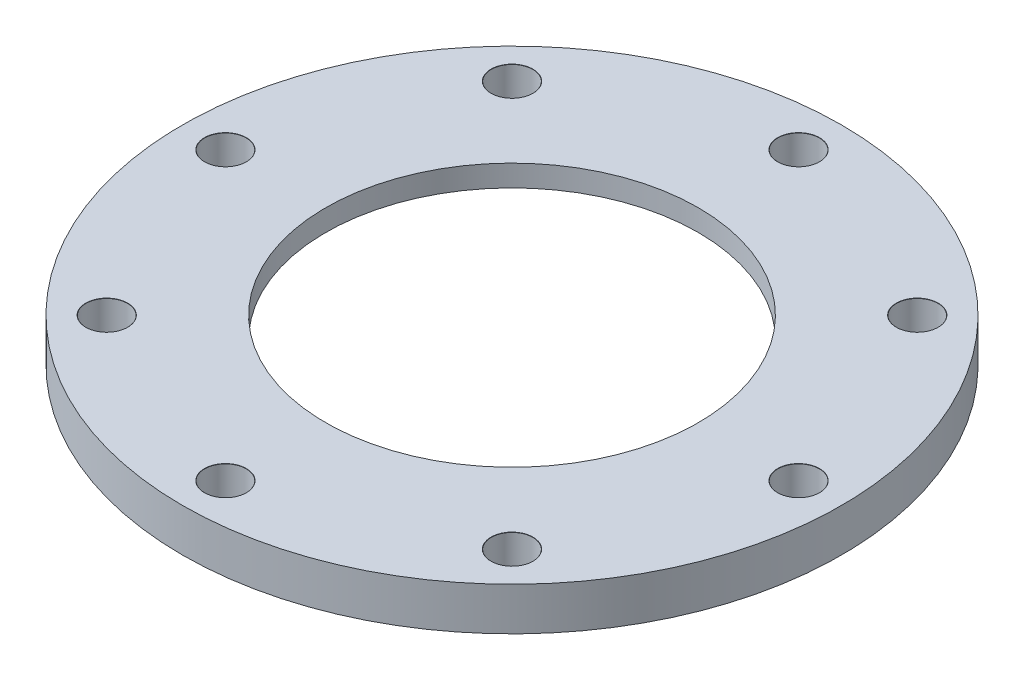
ISO-10303-21;
HEADER;
FILE_DESCRIPTION(('STEP AP214'),'2;1');
FILE_NAME('part.step','',(''),(''),'','','');
FILE_SCHEMA(('AUTOMOTIVE_DESIGN { 1 0 10303 214 1 1 1 1 }'));
ENDSEC;
DATA;
#1=APPLICATION_CONTEXT('core data for automotive mechanical design processes');
#2=APPLICATION_PROTOCOL_DEFINITION('international standard','automotive_design',2000,#1);
#3=PRODUCT_CONTEXT('',#1,'mechanical');
#4=PRODUCT('Part','Part','',(#3));
#5=PRODUCT_RELATED_PRODUCT_CATEGORY('part','',(#4));
#6=PRODUCT_DEFINITION_FORMATION('','',#4);
#7=PRODUCT_DEFINITION_CONTEXT('part definition',#1,'design');
#8=PRODUCT_DEFINITION('design','',#6,#7);
#9=PRODUCT_DEFINITION_SHAPE('','',#8);
#10=(LENGTH_UNIT() NAMED_UNIT(*) SI_UNIT(.MILLI.,.METRE.));
#11=(NAMED_UNIT(*) PLANE_ANGLE_UNIT() SI_UNIT($,.RADIAN.));
#12=(NAMED_UNIT(*) SI_UNIT($,.STERADIAN.) SOLID_ANGLE_UNIT());
#13=UNCERTAINTY_MEASURE_WITH_UNIT(LENGTH_MEASURE(1.E-05),#10,'distance_accuracy_value','');
#14=(GEOMETRIC_REPRESENTATION_CONTEXT(3) GLOBAL_UNCERTAINTY_ASSIGNED_CONTEXT((#13)) GLOBAL_UNIT_ASSIGNED_CONTEXT((#10,
#11,#12)) REPRESENTATION_CONTEXT('',''));
#15=CARTESIAN_POINT('',(0.,0.,0.));
#16=DIRECTION('',(0.,0.,1.));
#17=DIRECTION('',(1.,0.,0.));
#18=AXIS2_PLACEMENT_3D('',#15,#16,#17);
#19=CARTESIAN_POINT('',(-46.,6.,0.));
#20=DIRECTION('',(0.,-1.,0.));
#21=DIRECTION('',(0.,0.,-1.));
#22=AXIS2_PLACEMENT_3D('',#19,#20,#21);
#23=PLANE('',#22);
#24=CARTESIAN_POINT('',(28.2842712474622,6.,28.2842712474616));
#25=DIRECTION('',(0.,1.,0.));
#26=DIRECTION('',(0.,0.,1.));
#27=AXIS2_PLACEMENT_3D('',#24,#25,#26);
#28=CIRCLE('',#27,2.925);
#29=CARTESIAN_POINT('',(28.2842712474622,6.,31.2092712474616));
#30=VERTEX_POINT('',#29);
#31=EDGE_CURVE('E129',#30,#30,#28,.T.);
#32=ORIENTED_EDGE('',*,*,#31,.F.);
#33=EDGE_LOOP('',(#32));
#34=FACE_BOUND('',#33,.T.);
#35=CARTESIAN_POINT('',(4.18977760661176E-13,6.,40.));
#36=DIRECTION('',(0.,1.,0.));
#37=DIRECTION('',(0.,0.,1.));
#38=AXIS2_PLACEMENT_3D('',#35,#36,#37);
#39=CIRCLE('',#38,2.925);
#40=CARTESIAN_POINT('',(4.18977760661176E-13,6.,42.925));
#41=VERTEX_POINT('',#40);
#42=EDGE_CURVE('E120',#41,#41,#39,.T.);
#43=ORIENTED_EDGE('',*,*,#42,.F.);
#44=EDGE_LOOP('',(#43));
#45=FACE_BOUND('',#44,.T.);
#46=CARTESIAN_POINT('',(-1.39659253553725E-13,6.,-40.));
#47=DIRECTION('',(0.,1.,0.));
#48=DIRECTION('',(0.,0.,1.));
#49=AXIS2_PLACEMENT_3D('',#46,#47,#48);
#50=CIRCLE('',#49,2.925);
#51=CARTESIAN_POINT('',(-1.39659253553725E-13,6.,-37.075));
#52=VERTEX_POINT('',#51);
#53=EDGE_CURVE('E84',#52,#52,#50,.T.);
#54=ORIENTED_EDGE('',*,*,#53,.F.);
#55=EDGE_LOOP('',(#54));
#56=FACE_BOUND('',#55,.T.);
#57=CARTESIAN_POINT('',(28.2842712474619,6.,-28.284271247462));
#58=DIRECTION('',(0.,1.,0.));
#59=DIRECTION('',(0.,0.,1.));
#60=AXIS2_PLACEMENT_3D('',#57,#58,#59);
#61=CIRCLE('',#60,2.925);
#62=CARTESIAN_POINT('',(28.2842712474619,6.,-25.359271247462));
#63=VERTEX_POINT('',#62);
#64=EDGE_CURVE('E75',#63,#63,#61,.T.);
#65=ORIENTED_EDGE('',*,*,#64,.F.);
#66=EDGE_LOOP('',(#65));
#67=FACE_BOUND('',#66,.T.);
#68=CARTESIAN_POINT('',(40.,6.,0.));
#69=DIRECTION('',(0.,1.,0.));
#70=DIRECTION('',(0.,0.,1.));
#71=AXIS2_PLACEMENT_3D('',#68,#69,#70);
#72=CIRCLE('',#71,2.925);
#73=CARTESIAN_POINT('',(40.,6.,2.925));
#74=VERTEX_POINT('',#73);
#75=EDGE_CURVE('E66',#74,#74,#72,.T.);
#76=ORIENTED_EDGE('',*,*,#75,.F.);
#77=EDGE_LOOP('',(#76));
#78=FACE_BOUND('',#77,.T.);
#79=CARTESIAN_POINT('',(0.,6.,0.));
#80=DIRECTION('',(0.,-1.,0.));
#81=DIRECTION('',(0.,0.,-1.));
#82=AXIS2_PLACEMENT_3D('',#79,#80,#81);
#83=CIRCLE('',#82,46.);
#84=CARTESIAN_POINT('',(0.,6.,-46.));
#85=VERTEX_POINT('',#84);
#86=EDGE_CURVE('E45',#85,#85,#83,.T.);
#87=ORIENTED_EDGE('',*,*,#86,.F.);
#88=EDGE_LOOP('',(#87));
#89=FACE_BOUND('',#88,.T.);
#90=CARTESIAN_POINT('',(0.,6.,0.));
#91=DIRECTION('',(0.,-1.,0.));
#92=DIRECTION('',(0.,0.,-1.));
#93=AXIS2_PLACEMENT_3D('',#90,#91,#92);
#94=CIRCLE('',#93,26.);
#95=CARTESIAN_POINT('',(0.,6.,-26.));
#96=VERTEX_POINT('',#95);
#97=EDGE_CURVE('E49',#96,#96,#94,.T.);
#98=ORIENTED_EDGE('',*,*,#97,.T.);
#99=EDGE_LOOP('',(#98));
#100=FACE_BOUND('',#99,.T.);
#101=CARTESIAN_POINT('',(-28.2842712474621,6.,-28.2842712474618));
#102=DIRECTION('',(0.,1.,0.));
#103=DIRECTION('',(0.,0.,1.));
#104=AXIS2_PLACEMENT_3D('',#101,#102,#103);
#105=CIRCLE('',#104,2.925);
#106=CARTESIAN_POINT('',(-28.2842712474621,6.,-25.3592712474618));
#107=VERTEX_POINT('',#106);
#108=EDGE_CURVE('E93',#107,#107,#105,.T.);
#109=ORIENTED_EDGE('',*,*,#108,.F.);
#110=EDGE_LOOP('',(#109));
#111=FACE_BOUND('',#110,.T.);
#112=CARTESIAN_POINT('',(-40.,6.,0.));
#113=DIRECTION('',(0.,1.,0.));
#114=DIRECTION('',(0.,0.,1.));
#115=AXIS2_PLACEMENT_3D('',#112,#113,#114);
#116=CIRCLE('',#115,2.925);
#117=CARTESIAN_POINT('',(-40.,6.,2.925));
#118=VERTEX_POINT('',#117);
#119=EDGE_CURVE('E102',#118,#118,#116,.T.);
#120=ORIENTED_EDGE('',*,*,#119,.F.);
#121=EDGE_LOOP('',(#120));
#122=FACE_BOUND('',#121,.T.);
#123=CARTESIAN_POINT('',(-28.2842712474617,6.,28.2842712474621));
#124=DIRECTION('',(0.,1.,0.));
#125=DIRECTION('',(0.,0.,1.));
#126=AXIS2_PLACEMENT_3D('',#123,#124,#125);
#127=CIRCLE('',#126,2.925);
#128=CARTESIAN_POINT('',(-28.2842712474617,6.,31.2092712474621));
#129=VERTEX_POINT('',#128);
#130=EDGE_CURVE('E111',#129,#129,#127,.T.);
#131=ORIENTED_EDGE('',*,*,#130,.F.);
#132=EDGE_LOOP('',(#131));
#133=FACE_BOUND('',#132,.T.);
#134=ADVANCED_FACE('F34',(#34,#45,#56,#67,#78,#89,#100,#111,#122,#133),#23,.F.);
#135=CARTESIAN_POINT('',(0.,0.,0.));
#136=DIRECTION('',(0.,-1.,0.));
#137=DIRECTION('',(0.,0.,-1.));
#138=AXIS2_PLACEMENT_3D('',#135,#136,#137);
#139=CYLINDRICAL_SURFACE('',#138,32.);
#140=CARTESIAN_POINT('',(0.,3.,0.));
#141=DIRECTION('',(0.,-1.,0.));
#142=DIRECTION('',(0.,0.,-1.));
#143=AXIS2_PLACEMENT_3D('',#140,#141,#142);
#144=CIRCLE('',#143,32.);
#145=CARTESIAN_POINT('',(0.,3.,-32.));
#146=VERTEX_POINT('',#145);
#147=EDGE_CURVE('E57',#146,#146,#144,.T.);
#148=ORIENTED_EDGE('',*,*,#147,.F.);
#149=EDGE_LOOP('',(#148));
#150=FACE_BOUND('',#149,.T.);
#151=CARTESIAN_POINT('',(0.,0.,0.));
#152=DIRECTION('',(0.,-1.,0.));
#153=DIRECTION('',(0.,0.,-1.));
#154=AXIS2_PLACEMENT_3D('',#151,#152,#153);
#155=CIRCLE('',#154,32.);
#156=CARTESIAN_POINT('',(0.,0.,-32.));
#157=VERTEX_POINT('',#156);
#158=EDGE_CURVE('E10',#157,#157,#155,.T.);
#159=ORIENTED_EDGE('',*,*,#158,.T.);
#160=EDGE_LOOP('',(#159));
#161=FACE_BOUND('',#160,.T.);
#162=ADVANCED_FACE('F36',(#150,#161),#139,.F.);
#163=CARTESIAN_POINT('',(-32.,0.,0.));
#164=DIRECTION('',(0.,1.,0.));
#165=DIRECTION('',(0.,0.,1.));
#166=AXIS2_PLACEMENT_3D('',#163,#164,#165);
#167=PLANE('',#166);
#168=CARTESIAN_POINT('',(28.2842712474622,0.,28.2842712474616));
#169=DIRECTION('',(0.,1.,0.));
#170=DIRECTION('',(0.,0.,1.));
#171=AXIS2_PLACEMENT_3D('',#168,#169,#170);
#172=CIRCLE('',#171,2.9);
#173=CARTESIAN_POINT('',(28.2842712474622,0.,31.1842712474616));
#174=VERTEX_POINT('',#173);
#175=EDGE_CURVE('E123',#174,#174,#172,.T.);
#176=ORIENTED_EDGE('',*,*,#175,.T.);
#177=EDGE_LOOP('',(#176));
#178=FACE_BOUND('',#177,.T.);
#179=CARTESIAN_POINT('',(4.18977760661176E-13,0.,40.));
#180=DIRECTION('',(0.,1.,0.));
#181=DIRECTION('',(0.,0.,1.));
#182=AXIS2_PLACEMENT_3D('',#179,#180,#181);
#183=CIRCLE('',#182,2.9);
#184=CARTESIAN_POINT('',(4.18977760661176E-13,0.,42.9));
#185=VERTEX_POINT('',#184);
#186=EDGE_CURVE('E114',#185,#185,#183,.T.);
#187=ORIENTED_EDGE('',*,*,#186,.T.);
#188=EDGE_LOOP('',(#187));
#189=FACE_BOUND('',#188,.T.);
#190=CARTESIAN_POINT('',(-28.2842712474617,0.,28.2842712474621));
#191=DIRECTION('',(0.,1.,0.));
#192=DIRECTION('',(0.,0.,1.));
#193=AXIS2_PLACEMENT_3D('',#190,#191,#192);
#194=CIRCLE('',#193,2.9);
#195=CARTESIAN_POINT('',(-28.2842712474617,0.,31.1842712474621));
#196=VERTEX_POINT('',#195);
#197=EDGE_CURVE('E105',#196,#196,#194,.T.);
#198=ORIENTED_EDGE('',*,*,#197,.T.);
#199=EDGE_LOOP('',(#198));
#200=FACE_BOUND('',#199,.T.);
#201=CARTESIAN_POINT('',(-40.,0.,0.));
#202=DIRECTION('',(0.,1.,0.));
#203=DIRECTION('',(0.,0.,1.));
#204=AXIS2_PLACEMENT_3D('',#201,#202,#203);
#205=CIRCLE('',#204,2.9);
#206=CARTESIAN_POINT('',(-40.,0.,2.9));
#207=VERTEX_POINT('',#206);
#208=EDGE_CURVE('E96',#207,#207,#205,.T.);
#209=ORIENTED_EDGE('',*,*,#208,.T.);
#210=EDGE_LOOP('',(#209));
#211=FACE_BOUND('',#210,.T.);
#212=CARTESIAN_POINT('',(-28.2842712474621,0.,-28.2842712474618));
#213=DIRECTION('',(0.,1.,0.));
#214=DIRECTION('',(0.,0.,1.));
#215=AXIS2_PLACEMENT_3D('',#212,#213,#214);
#216=CIRCLE('',#215,2.9);
#217=CARTESIAN_POINT('',(-28.2842712474621,0.,-25.3842712474618));
#218=VERTEX_POINT('',#217);
#219=EDGE_CURVE('E87',#218,#218,#216,.T.);
#220=ORIENTED_EDGE('',*,*,#219,.T.);
#221=EDGE_LOOP('',(#220));
#222=FACE_BOUND('',#221,.T.);
#223=CARTESIAN_POINT('',(-1.39659253553725E-13,0.,-40.));
#224=DIRECTION('',(0.,1.,0.));
#225=DIRECTION('',(0.,0.,1.));
#226=AXIS2_PLACEMENT_3D('',#223,#224,#225);
#227=CIRCLE('',#226,2.9);
#228=CARTESIAN_POINT('',(-1.39659253553725E-13,0.,-37.1));
#229=VERTEX_POINT('',#228);
#230=EDGE_CURVE('E78',#229,#229,#227,.T.);
#231=ORIENTED_EDGE('',*,*,#230,.T.);
#232=EDGE_LOOP('',(#231));
#233=FACE_BOUND('',#232,.T.);
#234=CARTESIAN_POINT('',(28.2842712474619,0.,-28.284271247462));
#235=DIRECTION('',(0.,1.,0.));
#236=DIRECTION('',(0.,0.,1.));
#237=AXIS2_PLACEMENT_3D('',#234,#235,#236);
#238=CIRCLE('',#237,2.9);
#239=CARTESIAN_POINT('',(28.2842712474619,0.,-25.384271247462));
#240=VERTEX_POINT('',#239);
#241=EDGE_CURVE('E69',#240,#240,#238,.T.);
#242=ORIENTED_EDGE('',*,*,#241,.T.);
#243=EDGE_LOOP('',(#242));
#244=FACE_BOUND('',#243,.T.);
#245=CARTESIAN_POINT('',(40.,0.,0.));
#246=DIRECTION('',(0.,1.,0.));
#247=DIRECTION('',(0.,0.,1.));
#248=AXIS2_PLACEMENT_3D('',#245,#246,#247);
#249=CIRCLE('',#248,2.9);
#250=CARTESIAN_POINT('',(40.,0.,2.9));
#251=VERTEX_POINT('',#250);
#252=EDGE_CURVE('E60',#251,#251,#249,.T.);
#253=ORIENTED_EDGE('',*,*,#252,.T.);
#254=EDGE_LOOP('',(#253));
#255=FACE_BOUND('',#254,.T.);
#256=ORIENTED_EDGE('',*,*,#158,.F.);
#257=EDGE_LOOP('',(#256));
#258=FACE_BOUND('',#257,.T.);
#259=CARTESIAN_POINT('',(0.,0.,0.));
#260=DIRECTION('',(0.,-1.,0.));
#261=DIRECTION('',(0.,0.,-1.));
#262=AXIS2_PLACEMENT_3D('',#259,#260,#261);
#263=CIRCLE('',#262,46.);
#264=CARTESIAN_POINT('',(0.,0.,-46.));
#265=VERTEX_POINT('',#264);
#266=EDGE_CURVE('E41',#265,#265,#263,.T.);
#267=ORIENTED_EDGE('',*,*,#266,.T.);
#268=EDGE_LOOP('',(#267));
#269=FACE_BOUND('',#268,.T.);
#270=ADVANCED_FACE('F224',(#178,#189,#200,#211,#222,#233,#244,#255,#258,#269),#167,.F.);
#271=CARTESIAN_POINT('',(0.,0.,0.));
#272=DIRECTION('',(0.,-1.,0.));
#273=DIRECTION('',(0.,0.,-1.));
#274=AXIS2_PLACEMENT_3D('',#271,#272,#273);
#275=CYLINDRICAL_SURFACE('',#274,46.);
#276=ORIENTED_EDGE('',*,*,#266,.F.);
#277=EDGE_LOOP('',(#276));
#278=FACE_BOUND('',#277,.T.);
#279=ORIENTED_EDGE('',*,*,#86,.T.);
#280=EDGE_LOOP('',(#279));
#281=FACE_BOUND('',#280,.T.);
#282=ADVANCED_FACE('F220',(#278,#281),#275,.T.);
#283=CARTESIAN_POINT('',(0.,0.,0.));
#284=DIRECTION('',(0.,-1.,0.));
#285=DIRECTION('',(0.,0.,-1.));
#286=AXIS2_PLACEMENT_3D('',#283,#284,#285);
#287=CYLINDRICAL_SURFACE('',#286,26.);
#288=ORIENTED_EDGE('',*,*,#97,.F.);
#289=EDGE_LOOP('',(#288));
#290=FACE_BOUND('',#289,.T.);
#291=CARTESIAN_POINT('',(0.,3.,0.));
#292=DIRECTION('',(0.,-1.,0.));
#293=DIRECTION('',(0.,0.,-1.));
#294=AXIS2_PLACEMENT_3D('',#291,#292,#293);
#295=CIRCLE('',#294,26.);
#296=CARTESIAN_POINT('',(0.,3.,-26.));
#297=VERTEX_POINT('',#296);
#298=EDGE_CURVE('E54',#297,#297,#295,.T.);
#299=ORIENTED_EDGE('',*,*,#298,.T.);
#300=EDGE_LOOP('',(#299));
#301=FACE_BOUND('',#300,.T.);
#302=ADVANCED_FACE('F217',(#290,#301),#287,.F.);
#303=CARTESIAN_POINT('',(-26.,3.,0.));
#304=DIRECTION('',(0.,1.,0.));
#305=DIRECTION('',(0.,0.,1.));
#306=AXIS2_PLACEMENT_3D('',#303,#304,#305);
#307=PLANE('',#306);
#308=ORIENTED_EDGE('',*,*,#298,.F.);
#309=EDGE_LOOP('',(#308));
#310=FACE_BOUND('',#309,.T.);
#311=ORIENTED_EDGE('',*,*,#147,.T.);
#312=EDGE_LOOP('',(#311));
#313=FACE_BOUND('',#312,.T.);
#314=ADVANCED_FACE('F213',(#310,#313),#307,.F.);
#315=CARTESIAN_POINT('',(40.,6.,0.));
#316=DIRECTION('',(0.,1.,0.));
#317=DIRECTION('',(0.,0.,1.));
#318=AXIS2_PLACEMENT_3D('',#315,#316,#317);
#319=CYLINDRICAL_SURFACE('',#318,2.9);
#320=ORIENTED_EDGE('',*,*,#252,.F.);
#321=EDGE_LOOP('',(#320));
#322=FACE_BOUND('',#321,.T.);
#323=CARTESIAN_POINT('',(40.,5.97499999999999,0.));
#324=DIRECTION('',(0.,1.,0.));
#325=DIRECTION('',(0.,0.,1.));
#326=AXIS2_PLACEMENT_3D('',#323,#324,#325);
#327=CIRCLE('',#326,2.9);
#328=CARTESIAN_POINT('',(40.,5.97499999999999,2.9));
#329=VERTEX_POINT('',#328);
#330=EDGE_CURVE('E63',#329,#329,#327,.T.);
#331=ORIENTED_EDGE('',*,*,#330,.T.);
#332=EDGE_LOOP('',(#331));
#333=FACE_BOUND('',#332,.T.);
#334=ADVANCED_FACE('F209',(#322,#333),#319,.F.);
#335=CARTESIAN_POINT('',(40.,6.,0.));
#336=DIRECTION('',(0.,1.,0.));
#337=DIRECTION('',(0.,0.,1.));
#338=AXIS2_PLACEMENT_3D('',#335,#336,#337);
#339=CONICAL_SURFACE('',#338,2.925,0.785398163397448);
#340=ORIENTED_EDGE('',*,*,#330,.F.);
#341=EDGE_LOOP('',(#340));
#342=FACE_BOUND('',#341,.T.);
#343=ORIENTED_EDGE('',*,*,#75,.T.);
#344=EDGE_LOOP('',(#343));
#345=FACE_BOUND('',#344,.T.);
#346=ADVANCED_FACE('F205',(#342,#345),#339,.F.);
#347=CARTESIAN_POINT('',(28.2842712474619,6.,-28.284271247462));
#348=DIRECTION('',(0.,1.,0.));
#349=DIRECTION('',(0.,0.,1.));
#350=AXIS2_PLACEMENT_3D('',#347,#348,#349);
#351=CYLINDRICAL_SURFACE('',#350,2.9);
#352=ORIENTED_EDGE('',*,*,#241,.F.);
#353=EDGE_LOOP('',(#352));
#354=FACE_BOUND('',#353,.T.);
#355=CARTESIAN_POINT('',(28.2842712474619,5.97499999999999,-28.284271247462));
#356=DIRECTION('',(0.,1.,0.));
#357=DIRECTION('',(0.,0.,1.));
#358=AXIS2_PLACEMENT_3D('',#355,#356,#357);
#359=CIRCLE('',#358,2.9);
#360=CARTESIAN_POINT('',(28.2842712474619,5.97499999999999,-25.384271247462));
#361=VERTEX_POINT('',#360);
#362=EDGE_CURVE('E72',#361,#361,#359,.T.);
#363=ORIENTED_EDGE('',*,*,#362,.T.);
#364=EDGE_LOOP('',(#363));
#365=FACE_BOUND('',#364,.T.);
#366=ADVANCED_FACE('F201',(#354,#365),#351,.F.);
#367=CARTESIAN_POINT('',(28.2842712474619,6.,-28.284271247462));
#368=DIRECTION('',(0.,1.,0.));
#369=DIRECTION('',(0.,0.,1.));
#370=AXIS2_PLACEMENT_3D('',#367,#368,#369);
#371=CONICAL_SURFACE('',#370,2.925,0.785398163397448);
#372=ORIENTED_EDGE('',*,*,#362,.F.);
#373=EDGE_LOOP('',(#372));
#374=FACE_BOUND('',#373,.T.);
#375=ORIENTED_EDGE('',*,*,#64,.T.);
#376=EDGE_LOOP('',(#375));
#377=FACE_BOUND('',#376,.T.);
#378=ADVANCED_FACE('F197',(#374,#377),#371,.F.);
#379=CARTESIAN_POINT('',(-1.39659253553725E-13,6.,-40.));
#380=DIRECTION('',(0.,1.,0.));
#381=DIRECTION('',(0.,0.,1.));
#382=AXIS2_PLACEMENT_3D('',#379,#380,#381);
#383=CYLINDRICAL_SURFACE('',#382,2.9);
#384=ORIENTED_EDGE('',*,*,#230,.F.);
#385=EDGE_LOOP('',(#384));
#386=FACE_BOUND('',#385,.T.);
#387=CARTESIAN_POINT('',(-1.39659253553725E-13,5.97499999999999,-40.));
#388=DIRECTION('',(0.,1.,0.));
#389=DIRECTION('',(0.,0.,1.));
#390=AXIS2_PLACEMENT_3D('',#387,#388,#389);
#391=CIRCLE('',#390,2.9);
#392=CARTESIAN_POINT('',(-1.39659253553725E-13,5.97499999999999,-37.1));
#393=VERTEX_POINT('',#392);
#394=EDGE_CURVE('E81',#393,#393,#391,.T.);
#395=ORIENTED_EDGE('',*,*,#394,.T.);
#396=EDGE_LOOP('',(#395));
#397=FACE_BOUND('',#396,.T.);
#398=ADVANCED_FACE('F193',(#386,#397),#383,.F.);
#399=CARTESIAN_POINT('',(-1.39659253553725E-13,6.,-40.));
#400=DIRECTION('',(0.,1.,0.));
#401=DIRECTION('',(0.,0.,1.));
#402=AXIS2_PLACEMENT_3D('',#399,#400,#401);
#403=CONICAL_SURFACE('',#402,2.925,0.785398163397431);
#404=ORIENTED_EDGE('',*,*,#394,.F.);
#405=EDGE_LOOP('',(#404));
#406=FACE_BOUND('',#405,.T.);
#407=ORIENTED_EDGE('',*,*,#53,.T.);
#408=EDGE_LOOP('',(#407));
#409=FACE_BOUND('',#408,.T.);
#410=ADVANCED_FACE('F189',(#406,#409),#403,.F.);
#411=CARTESIAN_POINT('',(-28.2842712474621,6.,-28.2842712474618));
#412=DIRECTION('',(0.,1.,0.));
#413=DIRECTION('',(0.,0.,1.));
#414=AXIS2_PLACEMENT_3D('',#411,#412,#413);
#415=CYLINDRICAL_SURFACE('',#414,2.9);
#416=ORIENTED_EDGE('',*,*,#219,.F.);
#417=EDGE_LOOP('',(#416));
#418=FACE_BOUND('',#417,.T.);
#419=CARTESIAN_POINT('',(-28.2842712474621,5.97499999999999,-28.2842712474618));
#420=DIRECTION('',(0.,1.,0.));
#421=DIRECTION('',(0.,0.,1.));
#422=AXIS2_PLACEMENT_3D('',#419,#420,#421);
#423=CIRCLE('',#422,2.9);
#424=CARTESIAN_POINT('',(-28.2842712474621,5.97499999999999,-25.3842712474618));
#425=VERTEX_POINT('',#424);
#426=EDGE_CURVE('E90',#425,#425,#423,.T.);
#427=ORIENTED_EDGE('',*,*,#426,.T.);
#428=EDGE_LOOP('',(#427));
#429=FACE_BOUND('',#428,.T.);
#430=ADVANCED_FACE('F185',(#418,#429),#415,.F.);
#431=CARTESIAN_POINT('',(-28.2842712474621,6.,-28.2842712474618));
#432=DIRECTION('',(0.,1.,0.));
#433=DIRECTION('',(0.,0.,1.));
#434=AXIS2_PLACEMENT_3D('',#431,#432,#433);
#435=CONICAL_SURFACE('',#434,2.925,0.785398163397448);
#436=ORIENTED_EDGE('',*,*,#426,.F.);
#437=EDGE_LOOP('',(#436));
#438=FACE_BOUND('',#437,.T.);
#439=ORIENTED_EDGE('',*,*,#108,.T.);
#440=EDGE_LOOP('',(#439));
#441=FACE_BOUND('',#440,.T.);
#442=ADVANCED_FACE('F181',(#438,#441),#435,.F.);
#443=CARTESIAN_POINT('',(-40.,6.,0.));
#444=DIRECTION('',(0.,1.,0.));
#445=DIRECTION('',(0.,0.,1.));
#446=AXIS2_PLACEMENT_3D('',#443,#444,#445);
#447=CYLINDRICAL_SURFACE('',#446,2.9);
#448=ORIENTED_EDGE('',*,*,#208,.F.);
#449=EDGE_LOOP('',(#448));
#450=FACE_BOUND('',#449,.T.);
#451=CARTESIAN_POINT('',(-40.,5.97499999999999,0.));
#452=DIRECTION('',(0.,1.,0.));
#453=DIRECTION('',(0.,0.,1.));
#454=AXIS2_PLACEMENT_3D('',#451,#452,#453);
#455=CIRCLE('',#454,2.9);
#456=CARTESIAN_POINT('',(-40.,5.97499999999999,2.9));
#457=VERTEX_POINT('',#456);
#458=EDGE_CURVE('E99',#457,#457,#455,.T.);
#459=ORIENTED_EDGE('',*,*,#458,.T.);
#460=EDGE_LOOP('',(#459));
#461=FACE_BOUND('',#460,.T.);
#462=ADVANCED_FACE('F177',(#450,#461),#447,.F.);
#463=CARTESIAN_POINT('',(-40.,6.,0.));
#464=DIRECTION('',(0.,1.,0.));
#465=DIRECTION('',(0.,0.,1.));
#466=AXIS2_PLACEMENT_3D('',#463,#464,#465);
#467=CONICAL_SURFACE('',#466,2.925,0.785398163397448);
#468=ORIENTED_EDGE('',*,*,#458,.F.);
#469=EDGE_LOOP('',(#468));
#470=FACE_BOUND('',#469,.T.);
#471=ORIENTED_EDGE('',*,*,#119,.T.);
#472=EDGE_LOOP('',(#471));
#473=FACE_BOUND('',#472,.T.);
#474=ADVANCED_FACE('F169',(#470,#473),#467,.F.);
#475=CARTESIAN_POINT('',(-28.2842712474617,6.,28.2842712474621));
#476=DIRECTION('',(0.,1.,0.));
#477=DIRECTION('',(0.,0.,1.));
#478=AXIS2_PLACEMENT_3D('',#475,#476,#477);
#479=CYLINDRICAL_SURFACE('',#478,2.9);
#480=ORIENTED_EDGE('',*,*,#197,.F.);
#481=EDGE_LOOP('',(#480));
#482=FACE_BOUND('',#481,.T.);
#483=CARTESIAN_POINT('',(-28.2842712474617,5.97499999999999,28.2842712474621));
#484=DIRECTION('',(0.,1.,0.));
#485=DIRECTION('',(0.,0.,1.));
#486=AXIS2_PLACEMENT_3D('',#483,#484,#485);
#487=CIRCLE('',#486,2.9);
#488=CARTESIAN_POINT('',(-28.2842712474617,5.97499999999999,31.1842712474621));
#489=VERTEX_POINT('',#488);
#490=EDGE_CURVE('E108',#489,#489,#487,.T.);
#491=ORIENTED_EDGE('',*,*,#490,.T.);
#492=EDGE_LOOP('',(#491));
#493=FACE_BOUND('',#492,.T.);
#494=ADVANCED_FACE('F159',(#482,#493),#479,.F.);
#495=CARTESIAN_POINT('',(-28.2842712474617,6.,28.2842712474621));
#496=DIRECTION('',(0.,1.,0.));
#497=DIRECTION('',(0.,0.,1.));
#498=AXIS2_PLACEMENT_3D('',#495,#496,#497);
#499=CONICAL_SURFACE('',#498,2.925,0.785398163397448);
#500=ORIENTED_EDGE('',*,*,#490,.F.);
#501=EDGE_LOOP('',(#500));
#502=FACE_BOUND('',#501,.T.);
#503=ORIENTED_EDGE('',*,*,#130,.T.);
#504=EDGE_LOOP('',(#503));
#505=FACE_BOUND('',#504,.T.);
#506=ADVANCED_FACE('F156',(#502,#505),#499,.F.);
#507=CARTESIAN_POINT('',(4.18977760661176E-13,6.,40.));
#508=DIRECTION('',(0.,1.,0.));
#509=DIRECTION('',(0.,0.,1.));
#510=AXIS2_PLACEMENT_3D('',#507,#508,#509);
#511=CYLINDRICAL_SURFACE('',#510,2.9);
#512=ORIENTED_EDGE('',*,*,#186,.F.);
#513=EDGE_LOOP('',(#512));
#514=FACE_BOUND('',#513,.T.);
#515=CARTESIAN_POINT('',(4.18977760661176E-13,5.97499999999999,40.));
#516=DIRECTION('',(0.,1.,0.));
#517=DIRECTION('',(0.,0.,1.));
#518=AXIS2_PLACEMENT_3D('',#515,#516,#517);
#519=CIRCLE('',#518,2.9);
#520=CARTESIAN_POINT('',(4.18977760661176E-13,5.97499999999999,42.9));
#521=VERTEX_POINT('',#520);
#522=EDGE_CURVE('E117',#521,#521,#519,.T.);
#523=ORIENTED_EDGE('',*,*,#522,.T.);
#524=EDGE_LOOP('',(#523));
#525=FACE_BOUND('',#524,.T.);
#526=ADVANCED_FACE('F158',(#514,#525),#511,.F.);
#527=CARTESIAN_POINT('',(4.18977760661176E-13,6.,40.));
#528=DIRECTION('',(0.,1.,0.));
#529=DIRECTION('',(0.,0.,1.));
#530=AXIS2_PLACEMENT_3D('',#527,#528,#529);
#531=CONICAL_SURFACE('',#530,2.925,0.785398163397431);
#532=ORIENTED_EDGE('',*,*,#522,.F.);
#533=EDGE_LOOP('',(#532));
#534=FACE_BOUND('',#533,.T.);
#535=ORIENTED_EDGE('',*,*,#42,.T.);
#536=EDGE_LOOP('',(#535));
#537=FACE_BOUND('',#536,.T.);
#538=ADVANCED_FACE('F166',(#534,#537),#531,.F.);
#539=CARTESIAN_POINT('',(28.2842712474622,6.,28.2842712474616));
#540=DIRECTION('',(0.,1.,0.));
#541=DIRECTION('',(0.,0.,1.));
#542=AXIS2_PLACEMENT_3D('',#539,#540,#541);
#543=CYLINDRICAL_SURFACE('',#542,2.9);
#544=ORIENTED_EDGE('',*,*,#175,.F.);
#545=EDGE_LOOP('',(#544));
#546=FACE_BOUND('',#545,.T.);
#547=CARTESIAN_POINT('',(28.2842712474622,5.97499999999999,28.2842712474616));
#548=DIRECTION('',(0.,1.,0.));
#549=DIRECTION('',(0.,0.,1.));
#550=AXIS2_PLACEMENT_3D('',#547,#548,#549);
#551=CIRCLE('',#550,2.9);
#552=CARTESIAN_POINT('',(28.2842712474622,5.97499999999999,31.1842712474616));
#553=VERTEX_POINT('',#552);
#554=EDGE_CURVE('E126',#553,#553,#551,.T.);
#555=ORIENTED_EDGE('',*,*,#554,.T.);
#556=EDGE_LOOP('',(#555));
#557=FACE_BOUND('',#556,.T.);
#558=ADVANCED_FACE('F269',(#546,#557),#543,.F.);
#559=CARTESIAN_POINT('',(28.2842712474622,6.,28.2842712474616));
#560=DIRECTION('',(0.,1.,0.));
#561=DIRECTION('',(0.,0.,1.));
#562=AXIS2_PLACEMENT_3D('',#559,#560,#561);
#563=CONICAL_SURFACE('',#562,2.925,0.785398163397448);
#564=ORIENTED_EDGE('',*,*,#554,.F.);
#565=EDGE_LOOP('',(#564));
#566=FACE_BOUND('',#565,.T.);
#567=ORIENTED_EDGE('',*,*,#31,.T.);
#568=EDGE_LOOP('',(#567));
#569=FACE_BOUND('',#568,.T.);
#570=ADVANCED_FACE('F133',(#566,#569),#563,.F.);
#571=CLOSED_SHELL('',(#134,#162,#270,#282,#302,#314,#334,#346,#366,#378,#398,#410,#430,#442,
#462,#474,#494,#506,#526,#538,#558,#570));
#572=MANIFOLD_SOLID_BREP('B2',#571);
#573=ADVANCED_BREP_SHAPE_REPRESENTATION('',(#18,#572),#14);
#574=SHAPE_DEFINITION_REPRESENTATION(#9,#573);
ENDSEC;
END-ISO-10303-21;
